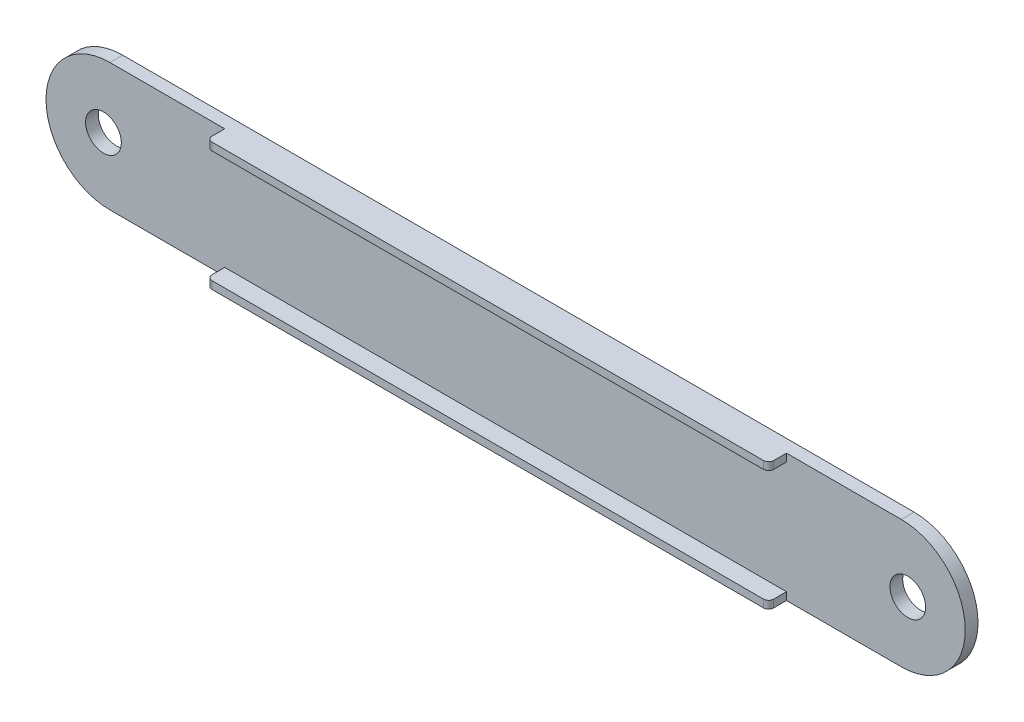
ISO-10303-21;
HEADER;
FILE_DESCRIPTION(('STEP AP214'),'2;1');
FILE_NAME('part.step','',(''),(''),'','','');
FILE_SCHEMA(('AUTOMOTIVE_DESIGN { 1 0 10303 214 1 1 1 1 }'));
ENDSEC;
DATA;
#1=APPLICATION_CONTEXT('core data for automotive mechanical design processes');
#2=APPLICATION_PROTOCOL_DEFINITION('international standard','automotive_design',2000,#1);
#3=PRODUCT_CONTEXT('',#1,'mechanical');
#4=PRODUCT('Part','Part','',(#3));
#5=PRODUCT_RELATED_PRODUCT_CATEGORY('part','',(#4));
#6=PRODUCT_DEFINITION_FORMATION('','',#4);
#7=PRODUCT_DEFINITION_CONTEXT('part definition',#1,'design');
#8=PRODUCT_DEFINITION('design','',#6,#7);
#9=PRODUCT_DEFINITION_SHAPE('','',#8);
#10=(LENGTH_UNIT() NAMED_UNIT(*) SI_UNIT(.MILLI.,.METRE.));
#11=(NAMED_UNIT(*) PLANE_ANGLE_UNIT() SI_UNIT($,.RADIAN.));
#12=(NAMED_UNIT(*) SI_UNIT($,.STERADIAN.) SOLID_ANGLE_UNIT());
#13=UNCERTAINTY_MEASURE_WITH_UNIT(LENGTH_MEASURE(1.E-05),#10,'distance_accuracy_value','');
#14=(GEOMETRIC_REPRESENTATION_CONTEXT(3) GLOBAL_UNCERTAINTY_ASSIGNED_CONTEXT((#13)) GLOBAL_UNIT_ASSIGNED_CONTEXT((#10,
#11,#12)) REPRESENTATION_CONTEXT('',''));
#15=CARTESIAN_POINT('',(0.,0.,0.));
#16=DIRECTION('',(0.,0.,1.));
#17=DIRECTION('',(1.,0.,0.));
#18=AXIS2_PLACEMENT_3D('',#15,#16,#17);
#19=CARTESIAN_POINT('',(-142.959039548023,-17.8177966101695,5.));
#20=DIRECTION('',(0.,1.,0.));
#21=DIRECTION('',(0.,0.,1.));
#22=AXIS2_PLACEMENT_3D('',#19,#20,#21);
#23=PLANE('',#22);
#24=DIRECTION('',(1.,0.,0.));
#25=VECTOR('',#24,1.);
#26=CARTESIAN_POINT('',(0.,-17.8177966101695,12.));
#27=LINE('',#26,#25);
#28=CARTESIAN_POINT('',(-95.9590395480226,-17.8177966101695,12.));
#29=VERTEX_POINT('',#28);
#30=CARTESIAN_POINT('',(120.040960451977,-17.8177966101695,12.));
#31=VERTEX_POINT('',#30);
#32=EDGE_CURVE('E164',#29,#31,#27,.T.);
#33=ORIENTED_EDGE('',*,*,#32,.F.);
#34=CARTESIAN_POINT('',(-95.9590395480226,-17.8177966101695,10.));
#35=DIRECTION('',(0.,-1.,0.));
#36=DIRECTION('',(0.,0.,-1.));
#37=AXIS2_PLACEMENT_3D('',#34,#35,#36);
#38=CIRCLE('',#37,2.);
#39=CARTESIAN_POINT('',(-97.9590395480226,-17.8177966101695,9.99999999999999));
#40=VERTEX_POINT('',#39);
#41=EDGE_CURVE('E149',#40,#29,#38,.F.);
#42=ORIENTED_EDGE('',*,*,#41,.F.);
#43=DIRECTION('',(0.,0.,-1.));
#44=VECTOR('',#43,1.);
#45=CARTESIAN_POINT('',(-97.9590395480226,-17.8177966101695,12.));
#46=LINE('',#45,#44);
#47=CARTESIAN_POINT('',(-97.9590395480226,-17.8177966101695,5.));
#48=VERTEX_POINT('',#47);
#49=EDGE_CURVE('E160',#40,#48,#46,.T.);
#50=ORIENTED_EDGE('',*,*,#49,.T.);
#51=DIRECTION('',(1.,0.,0.));
#52=VECTOR('',#51,1.);
#53=CARTESIAN_POINT('',(-142.959039548023,-17.8177966101695,5.));
#54=LINE('',#53,#52);
#55=CARTESIAN_POINT('',(-142.959039548023,-17.8177966101695,5.));
#56=VERTEX_POINT('',#55);
#57=EDGE_CURVE('E206',#56,#48,#54,.T.);
#58=ORIENTED_EDGE('',*,*,#57,.F.);
#59=DIRECTION('',(0.,0.,-1.));
#60=VECTOR('',#59,1.);
#61=CARTESIAN_POINT('',(-142.959039548023,-17.8177966101695,5.));
#62=LINE('',#61,#60);
#63=CARTESIAN_POINT('',(-142.959039548023,-17.8177966101695,0.));
#64=VERTEX_POINT('',#63);
#65=EDGE_CURVE('E230',#56,#64,#62,.T.);
#66=ORIENTED_EDGE('',*,*,#65,.T.);
#67=DIRECTION('',(1.,0.,0.));
#68=VECTOR('',#67,1.);
#69=CARTESIAN_POINT('',(-142.959039548023,-17.8177966101695,0.));
#70=LINE('',#69,#68);
#71=CARTESIAN_POINT('',(167.040960451977,-17.8177966101695,0.));
#72=VERTEX_POINT('',#71);
#73=EDGE_CURVE('E217',#64,#72,#70,.T.);
#74=ORIENTED_EDGE('',*,*,#73,.T.);
#75=DIRECTION('',(0.,0.,-1.));
#76=VECTOR('',#75,1.);
#77=CARTESIAN_POINT('',(167.040960451977,-17.8177966101695,5.));
#78=LINE('',#77,#76);
#79=CARTESIAN_POINT('',(167.040960451977,-17.8177966101695,5.));
#80=VERTEX_POINT('',#79);
#81=EDGE_CURVE('E227',#80,#72,#78,.T.);
#82=ORIENTED_EDGE('',*,*,#81,.F.);
#83=CARTESIAN_POINT('',(122.040960451977,-17.8177966101695,5.));
#84=VERTEX_POINT('',#83);
#85=EDGE_CURVE('E204',#84,#80,#54,.T.);
#86=ORIENTED_EDGE('',*,*,#85,.F.);
#87=DIRECTION('',(0.,0.,-1.));
#88=VECTOR('',#87,1.);
#89=CARTESIAN_POINT('',(122.040960451977,-17.8177966101695,12.));
#90=LINE('',#89,#88);
#91=CARTESIAN_POINT('',(122.040960451977,-17.8177966101695,9.99999999999999));
#92=VERTEX_POINT('',#91);
#93=EDGE_CURVE('E172',#92,#84,#90,.T.);
#94=ORIENTED_EDGE('',*,*,#93,.F.);
#95=CARTESIAN_POINT('',(120.040960451977,-17.8177966101695,10.));
#96=DIRECTION('',(0.,-1.,0.));
#97=DIRECTION('',(0.,0.,-1.));
#98=AXIS2_PLACEMENT_3D('',#95,#96,#97);
#99=CIRCLE('',#98,2.);
#100=EDGE_CURVE('E242',#92,#31,#99,.T.);
#101=ORIENTED_EDGE('',*,*,#100,.T.);
#102=EDGE_LOOP('',(#33,#42,#50,#58,#66,#74,#82,#86,#94,#101));
#103=FACE_BOUND('',#102,.T.);
#104=ADVANCED_FACE('F35',(#103),#23,.F.);
#105=CARTESIAN_POINT('',(-142.959039548023,32.1822033898305,5.));
#106=DIRECTION('',(0.,-1.,0.));
#107=DIRECTION('',(0.,0.,-1.));
#108=AXIS2_PLACEMENT_3D('',#105,#106,#107);
#109=PLANE('',#108);
#110=DIRECTION('',(0.,0.,-1.));
#111=VECTOR('',#110,1.);
#112=CARTESIAN_POINT('',(-97.9590395480226,32.1822033898305,12.));
#113=LINE('',#112,#111);
#114=CARTESIAN_POINT('',(-97.9590395480226,32.1822033898305,9.99999999999999));
#115=VERTEX_POINT('',#114);
#116=CARTESIAN_POINT('',(-97.9590395480226,32.1822033898305,5.));
#117=VERTEX_POINT('',#116);
#118=EDGE_CURVE('E187',#115,#117,#113,.T.);
#119=ORIENTED_EDGE('',*,*,#118,.F.);
#120=CARTESIAN_POINT('',(-95.9590395480226,32.1822033898305,10.));
#121=DIRECTION('',(0.,-1.,0.));
#122=DIRECTION('',(0.,0.,-1.));
#123=AXIS2_PLACEMENT_3D('',#120,#121,#122);
#124=CIRCLE('',#123,2.);
#125=CARTESIAN_POINT('',(-95.9590395480226,32.1822033898305,12.));
#126=VERTEX_POINT('',#125);
#127=EDGE_CURVE('E332',#115,#126,#124,.F.);
#128=ORIENTED_EDGE('',*,*,#127,.T.);
#129=DIRECTION('',(-1.,0.,0.));
#130=VECTOR('',#129,1.);
#131=CARTESIAN_POINT('',(0.,32.1822033898305,12.));
#132=LINE('',#131,#130);
#133=CARTESIAN_POINT('',(120.040960451977,32.1822033898305,12.));
#134=VERTEX_POINT('',#133);
#135=EDGE_CURVE('E184',#134,#126,#132,.T.);
#136=ORIENTED_EDGE('',*,*,#135,.F.);
#137=CARTESIAN_POINT('',(120.040960451977,32.1822033898305,10.));
#138=DIRECTION('',(0.,-1.,0.));
#139=DIRECTION('',(0.,0.,-1.));
#140=AXIS2_PLACEMENT_3D('',#137,#138,#139);
#141=CIRCLE('',#140,2.);
#142=CARTESIAN_POINT('',(122.040960451977,32.1822033898305,9.99999999999999));
#143=VERTEX_POINT('',#142);
#144=EDGE_CURVE('E50',#143,#134,#141,.T.);
#145=ORIENTED_EDGE('',*,*,#144,.F.);
#146=DIRECTION('',(0.,0.,-1.));
#147=VECTOR('',#146,1.);
#148=CARTESIAN_POINT('',(122.040960451977,32.1822033898305,12.));
#149=LINE('',#148,#147);
#150=CARTESIAN_POINT('',(122.040960451977,32.1822033898305,5.));
#151=VERTEX_POINT('',#150);
#152=EDGE_CURVE('E194',#143,#151,#149,.T.);
#153=ORIENTED_EDGE('',*,*,#152,.T.);
#154=DIRECTION('',(-1.,0.,0.));
#155=VECTOR('',#154,1.);
#156=CARTESIAN_POINT('',(-142.959039548023,32.1822033898305,5.));
#157=LINE('',#156,#155);
#158=CARTESIAN_POINT('',(167.040960451977,32.1822033898305,5.));
#159=VERTEX_POINT('',#158);
#160=EDGE_CURVE('E211',#159,#151,#157,.T.);
#161=ORIENTED_EDGE('',*,*,#160,.F.);
#162=DIRECTION('',(0.,0.,-1.));
#163=VECTOR('',#162,1.);
#164=CARTESIAN_POINT('',(167.040960451977,32.1822033898305,5.));
#165=LINE('',#164,#163);
#166=CARTESIAN_POINT('',(167.040960451977,32.1822033898305,0.));
#167=VERTEX_POINT('',#166);
#168=EDGE_CURVE('E224',#159,#167,#165,.T.);
#169=ORIENTED_EDGE('',*,*,#168,.T.);
#170=DIRECTION('',(-1.,0.,0.));
#171=VECTOR('',#170,1.);
#172=CARTESIAN_POINT('',(-142.959039548023,32.1822033898305,0.));
#173=LINE('',#172,#171);
#174=CARTESIAN_POINT('',(-142.959039548023,32.1822033898305,0.));
#175=VERTEX_POINT('',#174);
#176=EDGE_CURVE('E205',#167,#175,#173,.T.);
#177=ORIENTED_EDGE('',*,*,#176,.T.);
#178=DIRECTION('',(0.,0.,-1.));
#179=VECTOR('',#178,1.);
#180=CARTESIAN_POINT('',(-142.959039548023,32.1822033898305,5.));
#181=LINE('',#180,#179);
#182=CARTESIAN_POINT('',(-142.959039548023,32.1822033898305,5.));
#183=VERTEX_POINT('',#182);
#184=EDGE_CURVE('E214',#183,#175,#181,.T.);
#185=ORIENTED_EDGE('',*,*,#184,.F.);
#186=EDGE_CURVE('E210',#117,#183,#157,.T.);
#187=ORIENTED_EDGE('',*,*,#186,.F.);
#188=EDGE_LOOP('',(#119,#128,#136,#145,#153,#161,#169,#177,#185,#187));
#189=FACE_BOUND('',#188,.T.);
#190=ADVANCED_FACE('F290',(#189),#109,.F.);
#191=CARTESIAN_POINT('',(0.,29.1822033898305,12.));
#192=DIRECTION('',(0.,1.,0.));
#193=DIRECTION('',(0.,0.,1.));
#194=AXIS2_PLACEMENT_3D('',#191,#192,#193);
#195=PLANE('',#194);
#196=DIRECTION('',(1.,0.,0.));
#197=VECTOR('',#196,1.);
#198=CARTESIAN_POINT('',(0.,29.1822033898305,12.));
#199=LINE('',#198,#197);
#200=CARTESIAN_POINT('',(-95.9590395480226,29.1822033898305,12.));
#201=VERTEX_POINT('',#200);
#202=CARTESIAN_POINT('',(120.040960451977,29.1822033898305,12.));
#203=VERTEX_POINT('',#202);
#204=EDGE_CURVE('E181',#201,#203,#199,.T.);
#205=ORIENTED_EDGE('',*,*,#204,.F.);
#206=CARTESIAN_POINT('',(-95.9590395480226,29.1822033898305,10.));
#207=DIRECTION('',(0.,1.,0.));
#208=DIRECTION('',(0.,0.,1.));
#209=AXIS2_PLACEMENT_3D('',#206,#207,#208);
#210=CIRCLE('',#209,2.);
#211=CARTESIAN_POINT('',(-97.9590395480226,29.1822033898305,9.99999999999999));
#212=VERTEX_POINT('',#211);
#213=EDGE_CURVE('E58',#201,#212,#210,.F.);
#214=ORIENTED_EDGE('',*,*,#213,.T.);
#215=DIRECTION('',(0.,0.,-1.));
#216=VECTOR('',#215,1.);
#217=CARTESIAN_POINT('',(-97.9590395480226,29.1822033898305,12.));
#218=LINE('',#217,#216);
#219=CARTESIAN_POINT('',(-97.9590395480226,29.1822033898305,5.));
#220=VERTEX_POINT('',#219);
#221=EDGE_CURVE('E198',#212,#220,#218,.T.);
#222=ORIENTED_EDGE('',*,*,#221,.T.);
#223=DIRECTION('',(1.,0.,0.));
#224=VECTOR('',#223,1.);
#225=CARTESIAN_POINT('',(0.,29.1822033898305,5.));
#226=LINE('',#225,#224);
#227=CARTESIAN_POINT('',(122.040960451977,29.1822033898305,5.));
#228=VERTEX_POINT('',#227);
#229=EDGE_CURVE('E175',#220,#228,#226,.T.);
#230=ORIENTED_EDGE('',*,*,#229,.T.);
#231=DIRECTION('',(0.,0.,-1.));
#232=VECTOR('',#231,1.);
#233=CARTESIAN_POINT('',(122.040960451977,29.1822033898305,12.));
#234=LINE('',#233,#232);
#235=CARTESIAN_POINT('',(122.040960451977,29.1822033898305,9.99999999999999));
#236=VERTEX_POINT('',#235);
#237=EDGE_CURVE('E196',#236,#228,#234,.T.);
#238=ORIENTED_EDGE('',*,*,#237,.F.);
#239=CARTESIAN_POINT('',(120.040960451977,29.1822033898305,10.));
#240=DIRECTION('',(0.,1.,0.));
#241=DIRECTION('',(0.,0.,1.));
#242=AXIS2_PLACEMENT_3D('',#239,#240,#241);
#243=CIRCLE('',#242,2.);
#244=EDGE_CURVE('E338',#203,#236,#243,.T.);
#245=ORIENTED_EDGE('',*,*,#244,.F.);
#246=EDGE_LOOP('',(#205,#214,#222,#230,#238,#245));
#247=FACE_BOUND('',#246,.T.);
#248=ADVANCED_FACE('F302',(#247),#195,.F.);
#249=CARTESIAN_POINT('',(122.040960451978,5.64552851004807E-13,12.));
#250=DIRECTION('',(1.,0.,0.));
#251=DIRECTION('',(0.,1.,0.));
#252=AXIS2_PLACEMENT_3D('',#249,#250,#251);
#253=PLANE('',#252);
#254=ORIENTED_EDGE('',*,*,#152,.F.);
#255=DIRECTION('',(0.,-1.,0.));
#256=VECTOR('',#255,1.);
#257=CARTESIAN_POINT('',(122.040960451977,52.1822033898305,9.99999999999999));
#258=LINE('',#257,#256);
#259=EDGE_CURVE('E296',#143,#236,#258,.T.);
#260=ORIENTED_EDGE('',*,*,#259,.T.);
#261=ORIENTED_EDGE('',*,*,#237,.T.);
#262=DIRECTION('',(0.,-1.,0.));
#263=VECTOR('',#262,1.);
#264=CARTESIAN_POINT('',(122.040960451978,5.64552851004807E-13,5.));
#265=LINE('',#264,#263);
#266=EDGE_CURVE('E185',#151,#228,#265,.T.);
#267=ORIENTED_EDGE('',*,*,#266,.F.);
#268=EDGE_LOOP('',(#254,#260,#261,#267));
#269=FACE_BOUND('',#268,.T.);
#270=ADVANCED_FACE('F295',(#269),#253,.T.);
#271=CARTESIAN_POINT('',(-97.9590395480225,4.53151588234921E-13,12.));
#272=DIRECTION('',(-1.,0.,0.));
#273=DIRECTION('',(0.,-1.,0.));
#274=AXIS2_PLACEMENT_3D('',#271,#272,#273);
#275=PLANE('',#274);
#276=ORIENTED_EDGE('',*,*,#49,.F.);
#277=DIRECTION('',(0.,-1.,0.));
#278=VECTOR('',#277,1.);
#279=CARTESIAN_POINT('',(-97.9590395480226,52.1822033898305,9.99999999999999));
#280=LINE('',#279,#278);
#281=CARTESIAN_POINT('',(-97.9590395480226,-14.8177966101695,9.99999999999999));
#282=VERTEX_POINT('',#281);
#283=EDGE_CURVE('E146',#282,#40,#280,.T.);
#284=ORIENTED_EDGE('',*,*,#283,.F.);
#285=DIRECTION('',(0.,0.,-1.));
#286=VECTOR('',#285,1.);
#287=CARTESIAN_POINT('',(-97.9590395480226,-14.8177966101695,12.));
#288=LINE('',#287,#286);
#289=CARTESIAN_POINT('',(-97.9590395480226,-14.8177966101695,5.));
#290=VERTEX_POINT('',#289);
#291=EDGE_CURVE('E257',#282,#290,#288,.T.);
#292=ORIENTED_EDGE('',*,*,#291,.T.);
#293=DIRECTION('',(0.,1.,0.));
#294=VECTOR('',#293,1.);
#295=CARTESIAN_POINT('',(-97.9590395480225,4.53151588234921E-13,5.));
#296=LINE('',#295,#294);
#297=EDGE_CURVE('E170',#48,#290,#296,.T.);
#298=ORIENTED_EDGE('',*,*,#297,.F.);
#299=EDGE_LOOP('',(#276,#284,#292,#298));
#300=FACE_BOUND('',#299,.T.);
#301=ADVANCED_FACE('F168',(#300),#275,.T.);
#302=CARTESIAN_POINT('',(0.,-14.8177966101695,12.));
#303=DIRECTION('',(0.,1.,0.));
#304=DIRECTION('',(0.,0.,1.));
#305=AXIS2_PLACEMENT_3D('',#302,#303,#304);
#306=PLANE('',#305);
#307=CARTESIAN_POINT('',(-95.9590395480226,-14.8177966101695,10.));
#308=DIRECTION('',(0.,1.,0.));
#309=DIRECTION('',(0.,0.,1.));
#310=AXIS2_PLACEMENT_3D('',#307,#308,#309);
#311=CIRCLE('',#310,2.);
#312=CARTESIAN_POINT('',(-95.9590395480226,-14.8177966101695,12.));
#313=VERTEX_POINT('',#312);
#314=EDGE_CURVE('E152',#313,#282,#311,.F.);
#315=ORIENTED_EDGE('',*,*,#314,.F.);
#316=DIRECTION('',(1.,0.,0.));
#317=VECTOR('',#316,1.);
#318=CARTESIAN_POINT('',(0.,-14.8177966101695,12.));
#319=LINE('',#318,#317);
#320=CARTESIAN_POINT('',(120.040960451977,-14.8177966101695,12.));
#321=VERTEX_POINT('',#320);
#322=EDGE_CURVE('E254',#313,#321,#319,.T.);
#323=ORIENTED_EDGE('',*,*,#322,.T.);
#324=CARTESIAN_POINT('',(120.040960451977,-14.8177966101695,10.));
#325=DIRECTION('',(0.,1.,0.));
#326=DIRECTION('',(0.,0.,1.));
#327=AXIS2_PLACEMENT_3D('',#324,#325,#326);
#328=CIRCLE('',#327,2.);
#329=CARTESIAN_POINT('',(122.040960451977,-14.8177966101695,9.99999999999999));
#330=VERTEX_POINT('',#329);
#331=EDGE_CURVE('E245',#321,#330,#328,.T.);
#332=ORIENTED_EDGE('',*,*,#331,.T.);
#333=DIRECTION('',(0.,0.,-1.));
#334=VECTOR('',#333,1.);
#335=CARTESIAN_POINT('',(122.040960451977,-14.8177966101695,12.));
#336=LINE('',#335,#334);
#337=CARTESIAN_POINT('',(122.040960451977,-14.8177966101695,5.));
#338=VERTEX_POINT('',#337);
#339=EDGE_CURVE('E177',#330,#338,#336,.T.);
#340=ORIENTED_EDGE('',*,*,#339,.T.);
#341=DIRECTION('',(1.,0.,0.));
#342=VECTOR('',#341,1.);
#343=CARTESIAN_POINT('',(0.,-14.8177966101695,5.));
#344=LINE('',#343,#342);
#345=EDGE_CURVE('E255',#290,#338,#344,.T.);
#346=ORIENTED_EDGE('',*,*,#345,.F.);
#347=ORIENTED_EDGE('',*,*,#291,.F.);
#348=EDGE_LOOP('',(#315,#323,#332,#340,#346,#347));
#349=FACE_BOUND('',#348,.T.);
#350=ADVANCED_FACE('F272',(#349),#306,.T.);
#351=CARTESIAN_POINT('',(-142.959039548023,7.18220338983052,5.));
#352=DIRECTION('',(0.,0.,-1.));
#353=DIRECTION('',(-1.,0.,0.));
#354=AXIS2_PLACEMENT_3D('',#351,#352,#353);
#355=PLANE('',#354);
#356=ORIENTED_EDGE('',*,*,#57,.T.);
#357=ORIENTED_EDGE('',*,*,#297,.T.);
#358=ORIENTED_EDGE('',*,*,#345,.T.);
#359=DIRECTION('',(0.,1.,0.));
#360=VECTOR('',#359,1.);
#361=CARTESIAN_POINT('',(122.040960451977,-5.64552851004807E-13,5.));
#362=LINE('',#361,#360);
#363=EDGE_CURVE('E260',#84,#338,#362,.T.);
#364=ORIENTED_EDGE('',*,*,#363,.F.);
#365=ORIENTED_EDGE('',*,*,#85,.T.);
#366=CARTESIAN_POINT('',(167.040960451977,7.18220338983052,5.));
#367=DIRECTION('',(0.,0.,1.));
#368=DIRECTION('',(-1.,0.,0.));
#369=AXIS2_PLACEMENT_3D('',#366,#367,#368);
#370=CIRCLE('',#369,25.);
#371=EDGE_CURVE('E208',#80,#159,#370,.T.);
#372=ORIENTED_EDGE('',*,*,#371,.T.);
#373=ORIENTED_EDGE('',*,*,#160,.T.);
#374=ORIENTED_EDGE('',*,*,#266,.T.);
#375=ORIENTED_EDGE('',*,*,#229,.F.);
#376=DIRECTION('',(0.,-1.,0.));
#377=VECTOR('',#376,1.);
#378=CARTESIAN_POINT('',(-97.9590395480225,-4.5315158823492E-13,5.));
#379=LINE('',#378,#377);
#380=EDGE_CURVE('E171',#117,#220,#379,.T.);
#381=ORIENTED_EDGE('',*,*,#380,.F.);
#382=ORIENTED_EDGE('',*,*,#186,.T.);
#383=CARTESIAN_POINT('',(-142.959039548023,7.18220338983052,5.));
#384=DIRECTION('',(0.,0.,1.));
#385=DIRECTION('',(-1.,0.,0.));
#386=AXIS2_PLACEMENT_3D('',#383,#384,#385);
#387=CIRCLE('',#386,25.);
#388=EDGE_CURVE('E201',#183,#56,#387,.T.);
#389=ORIENTED_EDGE('',*,*,#388,.T.);
#390=EDGE_LOOP('',(#356,#357,#358,#364,#365,#372,#373,#374,#375,#381,#382,#389));
#391=FACE_BOUND('',#390,.T.);
#392=CARTESIAN_POINT('',(169.540960451978,7.1822033898316,5.));
#393=DIRECTION('',(0.,0.,1.));
#394=DIRECTION('',(1.,0.,0.));
#395=AXIS2_PLACEMENT_3D('',#392,#393,#394);
#396=CIRCLE('',#395,7.);
#397=CARTESIAN_POINT('',(176.540960451978,7.1822033898316,5.));
#398=VERTEX_POINT('',#397);
#399=EDGE_CURVE('E263',#398,#398,#396,.F.);
#400=ORIENTED_EDGE('',*,*,#399,.T.);
#401=EDGE_LOOP('',(#400));
#402=FACE_BOUND('',#401,.T.);
#403=CARTESIAN_POINT('',(-145.459039548023,7.18220338983052,5.));
#404=DIRECTION('',(0.,0.,1.));
#405=DIRECTION('',(1.,0.,0.));
#406=AXIS2_PLACEMENT_3D('',#403,#404,#405);
#407=CIRCLE('',#406,7.00000000000001);
#408=CARTESIAN_POINT('',(-138.459039548023,7.18220338983052,5.));
#409=VERTEX_POINT('',#408);
#410=EDGE_CURVE('E237',#409,#409,#407,.T.);
#411=ORIENTED_EDGE('',*,*,#410,.F.);
#412=EDGE_LOOP('',(#411));
#413=FACE_BOUND('',#412,.T.);
#414=ADVANCED_FACE('F276',(#391,#402,#413),#355,.F.);
#415=CARTESIAN_POINT('',(-142.959039548023,7.18220338983052,0.));
#416=DIRECTION('',(0.,0.,-1.));
#417=DIRECTION('',(-1.,0.,0.));
#418=AXIS2_PLACEMENT_3D('',#415,#416,#417);
#419=PLANE('',#418);
#420=CARTESIAN_POINT('',(169.540960451978,7.1822033898316,0.));
#421=DIRECTION('',(0.,0.,-1.));
#422=DIRECTION('',(-1.,0.,0.));
#423=AXIS2_PLACEMENT_3D('',#420,#421,#422);
#424=CIRCLE('',#423,7.);
#425=CARTESIAN_POINT('',(162.540960451978,7.1822033898316,0.));
#426=VERTEX_POINT('',#425);
#427=EDGE_CURVE('E233',#426,#426,#424,.F.);
#428=ORIENTED_EDGE('',*,*,#427,.T.);
#429=EDGE_LOOP('',(#428));
#430=FACE_BOUND('',#429,.T.);
#431=CARTESIAN_POINT('',(-142.959039548023,7.18220338983052,0.));
#432=DIRECTION('',(0.,0.,1.));
#433=DIRECTION('',(-1.,0.,0.));
#434=AXIS2_PLACEMENT_3D('',#431,#432,#433);
#435=CIRCLE('',#434,25.);
#436=EDGE_CURVE('E200',#175,#64,#435,.T.);
#437=ORIENTED_EDGE('',*,*,#436,.F.);
#438=ORIENTED_EDGE('',*,*,#176,.F.);
#439=CARTESIAN_POINT('',(167.040960451977,7.18220338983052,0.));
#440=DIRECTION('',(0.,0.,1.));
#441=DIRECTION('',(-1.,0.,0.));
#442=AXIS2_PLACEMENT_3D('',#439,#440,#441);
#443=CIRCLE('',#442,25.);
#444=EDGE_CURVE('E219',#72,#167,#443,.T.);
#445=ORIENTED_EDGE('',*,*,#444,.F.);
#446=ORIENTED_EDGE('',*,*,#73,.F.);
#447=EDGE_LOOP('',(#437,#438,#445,#446));
#448=FACE_BOUND('',#447,.T.);
#449=CARTESIAN_POINT('',(-145.459039548023,7.18220338983052,0.));
#450=DIRECTION('',(0.,0.,-1.));
#451=DIRECTION('',(-1.,0.,0.));
#452=AXIS2_PLACEMENT_3D('',#449,#450,#451);
#453=CIRCLE('',#452,7.00000000000001);
#454=CARTESIAN_POINT('',(-152.459039548023,7.18220338983052,0.));
#455=VERTEX_POINT('',#454);
#456=EDGE_CURVE('E236',#455,#455,#453,.T.);
#457=ORIENTED_EDGE('',*,*,#456,.F.);
#458=EDGE_LOOP('',(#457));
#459=FACE_BOUND('',#458,.T.);
#460=ADVANCED_FACE('F316',(#430,#448,#459),#419,.T.);
#461=CARTESIAN_POINT('',(-142.959039548023,7.18220338983052,5.));
#462=DIRECTION('',(0.,0.,-1.));
#463=DIRECTION('',(-1.,0.,0.));
#464=AXIS2_PLACEMENT_3D('',#461,#462,#463);
#465=CYLINDRICAL_SURFACE('',#464,25.);
#466=ORIENTED_EDGE('',*,*,#436,.T.);
#467=ORIENTED_EDGE('',*,*,#65,.F.);
#468=ORIENTED_EDGE('',*,*,#388,.F.);
#469=ORIENTED_EDGE('',*,*,#184,.T.);
#470=EDGE_LOOP('',(#466,#467,#468,#469));
#471=FACE_BOUND('',#470,.T.);
#472=ADVANCED_FACE('F37',(#471),#465,.T.);
#473=CARTESIAN_POINT('',(167.040960451977,7.18220338983052,5.));
#474=DIRECTION('',(0.,0.,-1.));
#475=DIRECTION('',(-1.,0.,0.));
#476=AXIS2_PLACEMENT_3D('',#473,#474,#475);
#477=CYLINDRICAL_SURFACE('',#476,25.);
#478=ORIENTED_EDGE('',*,*,#444,.T.);
#479=ORIENTED_EDGE('',*,*,#168,.F.);
#480=ORIENTED_EDGE('',*,*,#371,.F.);
#481=ORIENTED_EDGE('',*,*,#81,.T.);
#482=EDGE_LOOP('',(#478,#479,#480,#481));
#483=FACE_BOUND('',#482,.T.);
#484=ADVANCED_FACE('F285',(#483),#477,.T.);
#485=CARTESIAN_POINT('',(-97.9590395480225,-4.5315158823492E-13,12.));
#486=DIRECTION('',(1.,0.,0.));
#487=DIRECTION('',(0.,1.,0.));
#488=AXIS2_PLACEMENT_3D('',#485,#486,#487);
#489=PLANE('',#488);
#490=ORIENTED_EDGE('',*,*,#221,.F.);
#491=EDGE_CURVE('E156',#115,#212,#280,.T.);
#492=ORIENTED_EDGE('',*,*,#491,.F.);
#493=ORIENTED_EDGE('',*,*,#118,.T.);
#494=ORIENTED_EDGE('',*,*,#380,.T.);
#495=EDGE_LOOP('',(#490,#492,#493,#494));
#496=FACE_BOUND('',#495,.T.);
#497=ADVANCED_FACE('F307',(#496),#489,.F.);
#498=CARTESIAN_POINT('',(0.,0.,12.));
#499=DIRECTION('',(0.,0.,1.));
#500=DIRECTION('',(1.,0.,0.));
#501=AXIS2_PLACEMENT_3D('',#498,#499,#500);
#502=PLANE('',#501);
#503=DIRECTION('',(0.,-1.,0.));
#504=VECTOR('',#503,1.);
#505=CARTESIAN_POINT('',(-95.9590395480226,52.1822033898305,12.));
#506=LINE('',#505,#504);
#507=EDGE_CURVE('E341',#126,#201,#506,.T.);
#508=ORIENTED_EDGE('',*,*,#507,.T.);
#509=ORIENTED_EDGE('',*,*,#204,.T.);
#510=DIRECTION('',(0.,-1.,0.));
#511=VECTOR('',#510,1.);
#512=CARTESIAN_POINT('',(120.040960451977,52.1822033898305,12.));
#513=LINE('',#512,#511);
#514=EDGE_CURVE('E165',#134,#203,#513,.T.);
#515=ORIENTED_EDGE('',*,*,#514,.F.);
#516=ORIENTED_EDGE('',*,*,#135,.T.);
#517=EDGE_LOOP('',(#508,#509,#515,#516));
#518=FACE_BOUND('',#517,.T.);
#519=ADVANCED_FACE('F346',(#518),#502,.T.);
#520=CARTESIAN_POINT('',(122.040960451977,-5.64552851004807E-13,12.));
#521=DIRECTION('',(-1.,0.,0.));
#522=DIRECTION('',(0.,-1.,0.));
#523=AXIS2_PLACEMENT_3D('',#520,#521,#522);
#524=PLANE('',#523);
#525=ORIENTED_EDGE('',*,*,#339,.F.);
#526=EDGE_CURVE('E251',#330,#92,#258,.T.);
#527=ORIENTED_EDGE('',*,*,#526,.T.);
#528=ORIENTED_EDGE('',*,*,#93,.T.);
#529=ORIENTED_EDGE('',*,*,#363,.T.);
#530=EDGE_LOOP('',(#525,#527,#528,#529));
#531=FACE_BOUND('',#530,.T.);
#532=ADVANCED_FACE('F278',(#531),#524,.F.);
#533=CARTESIAN_POINT('',(0.,0.,12.));
#534=DIRECTION('',(0.,0.,1.));
#535=DIRECTION('',(1.,0.,0.));
#536=AXIS2_PLACEMENT_3D('',#533,#534,#535);
#537=PLANE('',#536);
#538=DIRECTION('',(0.,-1.,0.));
#539=VECTOR('',#538,1.);
#540=CARTESIAN_POINT('',(-95.9590395480226,52.1822033898305,12.));
#541=LINE('',#540,#539);
#542=EDGE_CURVE('E11',#29,#313,#541,.F.);
#543=ORIENTED_EDGE('',*,*,#542,.F.);
#544=ORIENTED_EDGE('',*,*,#32,.T.);
#545=DIRECTION('',(0.,-1.,0.));
#546=VECTOR('',#545,1.);
#547=CARTESIAN_POINT('',(120.040960451977,52.1822033898305,12.));
#548=LINE('',#547,#546);
#549=EDGE_CURVE('E43',#321,#31,#548,.T.);
#550=ORIENTED_EDGE('',*,*,#549,.F.);
#551=ORIENTED_EDGE('',*,*,#322,.F.);
#552=EDGE_LOOP('',(#543,#544,#550,#551));
#553=FACE_BOUND('',#552,.T.);
#554=ADVANCED_FACE('F253',(#553),#537,.T.);
#555=CARTESIAN_POINT('',(169.540960451978,7.1822033898316,-2.));
#556=DIRECTION('',(0.,0.,1.));
#557=DIRECTION('',(1.,0.,0.));
#558=AXIS2_PLACEMENT_3D('',#555,#556,#557);
#559=CYLINDRICAL_SURFACE('',#558,7.);
#560=ORIENTED_EDGE('',*,*,#427,.F.);
#561=EDGE_LOOP('',(#560));
#562=FACE_BOUND('',#561,.T.);
#563=ORIENTED_EDGE('',*,*,#399,.F.);
#564=EDGE_LOOP('',(#563));
#565=FACE_BOUND('',#564,.T.);
#566=ADVANCED_FACE('F326',(#562,#565),#559,.F.);
#567=CARTESIAN_POINT('',(-145.459039548023,7.18220338983052,-2.));
#568=DIRECTION('',(0.,0.,1.));
#569=DIRECTION('',(1.,0.,0.));
#570=AXIS2_PLACEMENT_3D('',#567,#568,#569);
#571=CYLINDRICAL_SURFACE('',#570,7.00000000000001);
#572=ORIENTED_EDGE('',*,*,#456,.T.);
#573=EDGE_LOOP('',(#572));
#574=FACE_BOUND('',#573,.T.);
#575=ORIENTED_EDGE('',*,*,#410,.T.);
#576=EDGE_LOOP('',(#575));
#577=FACE_BOUND('',#576,.T.);
#578=ADVANCED_FACE('F323',(#574,#577),#571,.F.);
#579=CARTESIAN_POINT('',(120.040960451977,52.1822033898305,10.));
#580=DIRECTION('',(0.,-1.,0.));
#581=DIRECTION('',(0.,0.,-1.));
#582=AXIS2_PLACEMENT_3D('',#579,#580,#581);
#583=CYLINDRICAL_SURFACE('',#582,2.);
#584=ORIENTED_EDGE('',*,*,#549,.T.);
#585=ORIENTED_EDGE('',*,*,#100,.F.);
#586=ORIENTED_EDGE('',*,*,#526,.F.);
#587=ORIENTED_EDGE('',*,*,#331,.F.);
#588=EDGE_LOOP('',(#584,#585,#586,#587));
#589=FACE_BOUND('',#588,.T.);
#590=ADVANCED_FACE('F241',(#589),#583,.T.);
#591=CARTESIAN_POINT('',(-95.9590395480226,52.1822033898305,10.));
#592=DIRECTION('',(0.,-1.,0.));
#593=DIRECTION('',(0.,0.,-1.));
#594=AXIS2_PLACEMENT_3D('',#591,#592,#593);
#595=CYLINDRICAL_SURFACE('',#594,2.);
#596=ORIENTED_EDGE('',*,*,#314,.T.);
#597=ORIENTED_EDGE('',*,*,#283,.T.);
#598=ORIENTED_EDGE('',*,*,#41,.T.);
#599=ORIENTED_EDGE('',*,*,#542,.T.);
#600=EDGE_LOOP('',(#596,#597,#598,#599));
#601=FACE_BOUND('',#600,.T.);
#602=ADVANCED_FACE('F148',(#601),#595,.T.);
#603=ORIENTED_EDGE('',*,*,#144,.T.);
#604=ORIENTED_EDGE('',*,*,#514,.T.);
#605=ORIENTED_EDGE('',*,*,#244,.T.);
#606=ORIENTED_EDGE('',*,*,#259,.F.);
#607=EDGE_LOOP('',(#603,#604,#605,#606));
#608=FACE_BOUND('',#607,.T.);
#609=ADVANCED_FACE('F347',(#608),#583,.T.);
#610=ORIENTED_EDGE('',*,*,#491,.T.);
#611=ORIENTED_EDGE('',*,*,#213,.F.);
#612=ORIENTED_EDGE('',*,*,#507,.F.);
#613=ORIENTED_EDGE('',*,*,#127,.F.);
#614=EDGE_LOOP('',(#610,#611,#612,#613));
#615=FACE_BOUND('',#614,.T.);
#616=ADVANCED_FACE('F345',(#615),#595,.T.);
#617=CLOSED_SHELL('',(#104,#190,#248,#270,#301,#350,#414,#460,#472,#484,#497,#519,#532,#554,
#566,#578,#590,#602,#609,#616));
#618=MANIFOLD_SOLID_BREP('B2',#617);
#619=ADVANCED_BREP_SHAPE_REPRESENTATION('',(#18,#618),#14);
#620=SHAPE_DEFINITION_REPRESENTATION(#9,#619);
ENDSEC;
END-ISO-10303-21;
